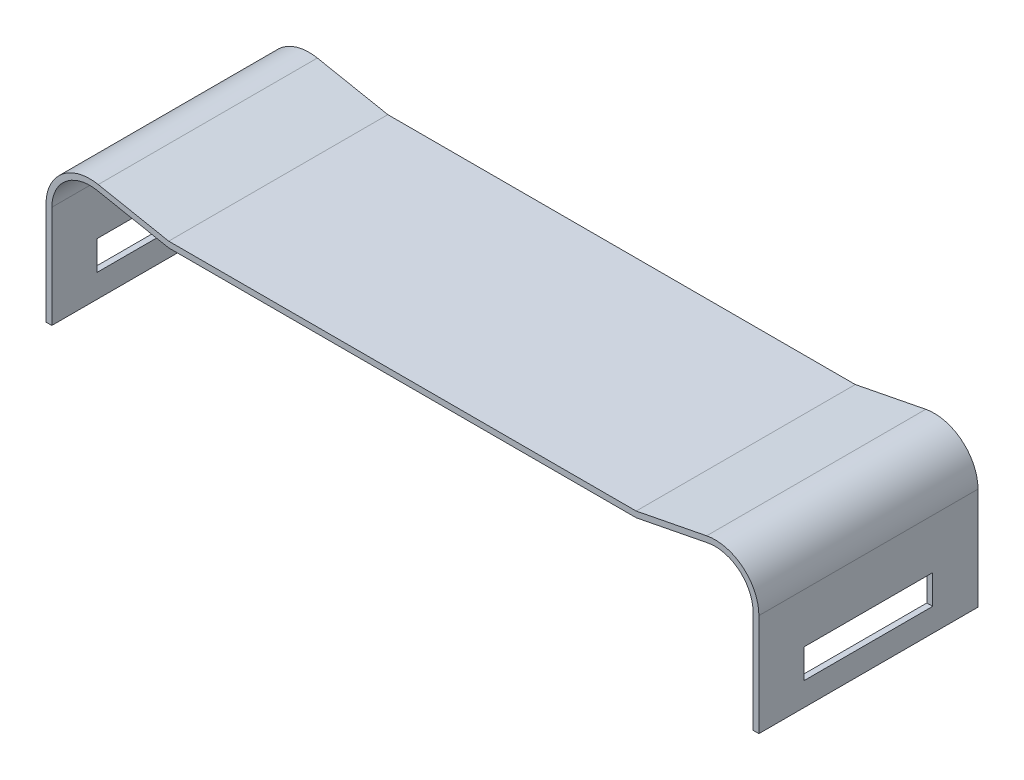
ISO-10303-21;
HEADER;
FILE_DESCRIPTION(('STEP AP214'),'2;1');
FILE_NAME('part.step','',(''),(''),'','','');
FILE_SCHEMA(('AUTOMOTIVE_DESIGN { 1 0 10303 214 1 1 1 1 }'));
ENDSEC;
DATA;
#1=APPLICATION_CONTEXT('core data for automotive mechanical design processes');
#2=APPLICATION_PROTOCOL_DEFINITION('international standard','automotive_design',2000,#1);
#3=PRODUCT_CONTEXT('',#1,'mechanical');
#4=PRODUCT('Part','Part','',(#3));
#5=PRODUCT_RELATED_PRODUCT_CATEGORY('part','',(#4));
#6=PRODUCT_DEFINITION_FORMATION('','',#4);
#7=PRODUCT_DEFINITION_CONTEXT('part definition',#1,'design');
#8=PRODUCT_DEFINITION('design','',#6,#7);
#9=PRODUCT_DEFINITION_SHAPE('','',#8);
#10=(LENGTH_UNIT() NAMED_UNIT(*) SI_UNIT(.MILLI.,.METRE.));
#11=(NAMED_UNIT(*) PLANE_ANGLE_UNIT() SI_UNIT($,.RADIAN.));
#12=(NAMED_UNIT(*) SI_UNIT($,.STERADIAN.) SOLID_ANGLE_UNIT());
#13=UNCERTAINTY_MEASURE_WITH_UNIT(LENGTH_MEASURE(1.E-05),#10,'distance_accuracy_value','');
#14=(GEOMETRIC_REPRESENTATION_CONTEXT(3) GLOBAL_UNCERTAINTY_ASSIGNED_CONTEXT((#13)) GLOBAL_UNIT_ASSIGNED_CONTEXT((#10,
#11,#12)) REPRESENTATION_CONTEXT('',''));
#15=CARTESIAN_POINT('',(0.,0.,0.));
#16=DIRECTION('',(0.,0.,1.));
#17=DIRECTION('',(1.,0.,0.));
#18=AXIS2_PLACEMENT_3D('',#15,#16,#17);
#19=CARTESIAN_POINT('',(24.,13.9,29.9));
#20=DIRECTION('',(0.,1.,0.));
#21=DIRECTION('',(-1.,0.,0.));
#22=AXIS2_PLACEMENT_3D('',#19,#20,#21);
#23=PLANE('',#22);
#24=DIRECTION('',(-1.,0.,0.));
#25=VECTOR('',#24,1.);
#26=CARTESIAN_POINT('',(24.,13.9,29.9));
#27=LINE('',#26,#25);
#28=CARTESIAN_POINT('',(24.,13.9,29.9));
#29=VERTEX_POINT('',#28);
#30=CARTESIAN_POINT('',(24.4,13.9,29.9));
#31=VERTEX_POINT('',#30);
#32=EDGE_CURVE('E306',#29,#31,#27,.F.);
#33=ORIENTED_EDGE('',*,*,#32,.F.);
#34=DIRECTION('',(0.,0.,1.));
#35=VECTOR('',#34,1.);
#36=CARTESIAN_POINT('',(24.,13.9,29.9));
#37=LINE('',#36,#35);
#38=CARTESIAN_POINT('',(24.,13.9,14.9));
#39=VERTEX_POINT('',#38);
#40=EDGE_CURVE('E190',#29,#39,#37,.F.);
#41=ORIENTED_EDGE('',*,*,#40,.T.);
#42=DIRECTION('',(-1.,0.,0.));
#43=VECTOR('',#42,1.);
#44=CARTESIAN_POINT('',(24.,13.9,14.9));
#45=LINE('',#44,#43);
#46=CARTESIAN_POINT('',(24.4,13.9,14.9));
#47=VERTEX_POINT('',#46);
#48=EDGE_CURVE('E198',#47,#39,#45,.T.);
#49=ORIENTED_EDGE('',*,*,#48,.F.);
#50=DIRECTION('',(0.,0.,1.));
#51=VECTOR('',#50,1.);
#52=CARTESIAN_POINT('',(24.4,13.9,29.9));
#53=LINE('',#52,#51);
#54=EDGE_CURVE('E241',#47,#31,#53,.T.);
#55=ORIENTED_EDGE('',*,*,#54,.T.);
#56=EDGE_LOOP('',(#33,#41,#49,#55));
#57=FACE_BOUND('',#56,.T.);
#58=ADVANCED_FACE('F17',(#57),#23,.F.);
#59=CARTESIAN_POINT('',(24.4,15.5,26.8));
#60=DIRECTION('',(0.,0.,1.));
#61=DIRECTION('',(0.,-1.,0.));
#62=AXIS2_PLACEMENT_3D('',#59,#60,#61);
#63=PLANE('',#62);
#64=DIRECTION('',(1.,0.,0.));
#65=VECTOR('',#64,1.);
#66=CARTESIAN_POINT('',(24.4,15.5,26.8));
#67=LINE('',#66,#65);
#68=CARTESIAN_POINT('',(24.4,15.5,26.8));
#69=VERTEX_POINT('',#68);
#70=CARTESIAN_POINT('',(24.,15.5,26.8));
#71=VERTEX_POINT('',#70);
#72=EDGE_CURVE('E304',#69,#71,#67,.F.);
#73=ORIENTED_EDGE('',*,*,#72,.T.);
#74=DIRECTION('',(0.,1.,0.));
#75=VECTOR('',#74,1.);
#76=CARTESIAN_POINT('',(24.,20.907589769271,26.8));
#77=LINE('',#76,#75);
#78=CARTESIAN_POINT('',(24.,17.5,26.8));
#79=VERTEX_POINT('',#78);
#80=EDGE_CURVE('E249',#71,#79,#77,.T.);
#81=ORIENTED_EDGE('',*,*,#80,.T.);
#82=DIRECTION('',(1.,0.,0.));
#83=VECTOR('',#82,1.);
#84=CARTESIAN_POINT('',(24.4,17.5,26.8));
#85=LINE('',#84,#83);
#86=CARTESIAN_POINT('',(24.4,17.5,26.8));
#87=VERTEX_POINT('',#86);
#88=EDGE_CURVE('E291',#79,#87,#85,.T.);
#89=ORIENTED_EDGE('',*,*,#88,.T.);
#90=DIRECTION('',(0.,-1.,0.));
#91=VECTOR('',#90,1.);
#92=CARTESIAN_POINT('',(24.4,13.9,26.8));
#93=LINE('',#92,#91);
#94=EDGE_CURVE('E238',#87,#69,#93,.T.);
#95=ORIENTED_EDGE('',*,*,#94,.T.);
#96=EDGE_LOOP('',(#73,#81,#89,#95));
#97=FACE_BOUND('',#96,.T.);
#98=ADVANCED_FACE('F551',(#97),#63,.F.);
#99=CARTESIAN_POINT('',(24.4,15.5,18.));
#100=DIRECTION('',(0.,-1.,0.));
#101=DIRECTION('',(0.,0.,-1.));
#102=AXIS2_PLACEMENT_3D('',#99,#100,#101);
#103=PLANE('',#102);
#104=DIRECTION('',(1.,0.,0.));
#105=VECTOR('',#104,1.);
#106=CARTESIAN_POINT('',(24.4,15.5,18.));
#107=LINE('',#106,#105);
#108=CARTESIAN_POINT('',(24.4,15.5,18.));
#109=VERTEX_POINT('',#108);
#110=CARTESIAN_POINT('',(24.,15.5,18.));
#111=VERTEX_POINT('',#110);
#112=EDGE_CURVE('E302',#109,#111,#107,.F.);
#113=ORIENTED_EDGE('',*,*,#112,.T.);
#114=DIRECTION('',(0.,0.,1.));
#115=VECTOR('',#114,1.);
#116=CARTESIAN_POINT('',(24.,15.5,29.9));
#117=LINE('',#116,#115);
#118=EDGE_CURVE('E252',#111,#71,#117,.T.);
#119=ORIENTED_EDGE('',*,*,#118,.T.);
#120=ORIENTED_EDGE('',*,*,#72,.F.);
#121=DIRECTION('',(0.,0.,1.));
#122=VECTOR('',#121,1.);
#123=CARTESIAN_POINT('',(24.4,15.5,29.9));
#124=LINE('',#123,#122);
#125=EDGE_CURVE('E235',#69,#109,#124,.F.);
#126=ORIENTED_EDGE('',*,*,#125,.T.);
#127=EDGE_LOOP('',(#113,#119,#120,#126));
#128=FACE_BOUND('',#127,.T.);
#129=ADVANCED_FACE('F548',(#128),#103,.F.);
#130=CARTESIAN_POINT('',(24.4,15.5,18.));
#131=DIRECTION('',(0.,0.,-1.));
#132=DIRECTION('',(0.,1.,0.));
#133=AXIS2_PLACEMENT_3D('',#130,#131,#132);
#134=PLANE('',#133);
#135=DIRECTION('',(1.,0.,0.));
#136=VECTOR('',#135,1.);
#137=CARTESIAN_POINT('',(24.4,17.5,18.));
#138=LINE('',#137,#136);
#139=CARTESIAN_POINT('',(24.4,17.5,18.));
#140=VERTEX_POINT('',#139);
#141=CARTESIAN_POINT('',(24.,17.5,18.));
#142=VERTEX_POINT('',#141);
#143=EDGE_CURVE('E299',#140,#142,#138,.F.);
#144=ORIENTED_EDGE('',*,*,#143,.T.);
#145=DIRECTION('',(0.,1.,0.));
#146=VECTOR('',#145,1.);
#147=CARTESIAN_POINT('',(24.,20.907589769271,18.));
#148=LINE('',#147,#146);
#149=EDGE_CURVE('E255',#142,#111,#148,.F.);
#150=ORIENTED_EDGE('',*,*,#149,.T.);
#151=ORIENTED_EDGE('',*,*,#112,.F.);
#152=DIRECTION('',(0.,-1.,0.));
#153=VECTOR('',#152,1.);
#154=CARTESIAN_POINT('',(24.4,13.9,18.));
#155=LINE('',#154,#153);
#156=EDGE_CURVE('E232',#109,#140,#155,.F.);
#157=ORIENTED_EDGE('',*,*,#156,.T.);
#158=EDGE_LOOP('',(#144,#150,#151,#157));
#159=FACE_BOUND('',#158,.T.);
#160=ADVANCED_FACE('F544',(#159),#134,.F.);
#161=CARTESIAN_POINT('',(24.4,17.5,18.));
#162=DIRECTION('',(0.,1.,0.));
#163=DIRECTION('',(0.,0.,1.));
#164=AXIS2_PLACEMENT_3D('',#161,#162,#163);
#165=PLANE('',#164);
#166=ORIENTED_EDGE('',*,*,#88,.F.);
#167=DIRECTION('',(0.,0.,1.));
#168=VECTOR('',#167,1.);
#169=CARTESIAN_POINT('',(24.,17.5,29.9));
#170=LINE('',#169,#168);
#171=EDGE_CURVE('E244',#79,#142,#170,.F.);
#172=ORIENTED_EDGE('',*,*,#171,.T.);
#173=ORIENTED_EDGE('',*,*,#143,.F.);
#174=DIRECTION('',(0.,0.,1.));
#175=VECTOR('',#174,1.);
#176=CARTESIAN_POINT('',(24.4,17.5,29.9));
#177=LINE('',#176,#175);
#178=EDGE_CURVE('E229',#140,#87,#177,.T.);
#179=ORIENTED_EDGE('',*,*,#178,.T.);
#180=EDGE_LOOP('',(#166,#172,#173,#179));
#181=FACE_BOUND('',#180,.T.);
#182=ADVANCED_FACE('F541',(#181),#165,.F.);
#183=CARTESIAN_POINT('',(-24.,13.9,29.9));
#184=DIRECTION('',(0.,1.,0.));
#185=DIRECTION('',(-1.,0.,0.));
#186=AXIS2_PLACEMENT_3D('',#183,#184,#185);
#187=PLANE('',#186);
#188=DIRECTION('',(-1.,0.,0.));
#189=VECTOR('',#188,1.);
#190=CARTESIAN_POINT('',(-24.,13.9,29.9));
#191=LINE('',#190,#189);
#192=CARTESIAN_POINT('',(-24.4,13.9,29.9));
#193=VERTEX_POINT('',#192);
#194=CARTESIAN_POINT('',(-24.,13.9,29.9));
#195=VERTEX_POINT('',#194);
#196=EDGE_CURVE('E288',#193,#195,#191,.F.);
#197=ORIENTED_EDGE('',*,*,#196,.F.);
#198=DIRECTION('',(0.,0.,1.));
#199=VECTOR('',#198,1.);
#200=CARTESIAN_POINT('',(-24.4,13.9,29.9));
#201=LINE('',#200,#199);
#202=CARTESIAN_POINT('',(-24.4,13.9,14.9));
#203=VERTEX_POINT('',#202);
#204=EDGE_CURVE('E228',#193,#203,#201,.F.);
#205=ORIENTED_EDGE('',*,*,#204,.T.);
#206=DIRECTION('',(-1.,0.,0.));
#207=VECTOR('',#206,1.);
#208=CARTESIAN_POINT('',(-24.,13.9,14.9));
#209=LINE('',#208,#207);
#210=CARTESIAN_POINT('',(-24.,13.9,14.9));
#211=VERTEX_POINT('',#210);
#212=EDGE_CURVE('E289',#211,#203,#209,.T.);
#213=ORIENTED_EDGE('',*,*,#212,.F.);
#214=DIRECTION('',(0.,0.,1.));
#215=VECTOR('',#214,1.);
#216=CARTESIAN_POINT('',(-24.,13.9,29.9));
#217=LINE('',#216,#215);
#218=EDGE_CURVE('E393',#211,#195,#217,.T.);
#219=ORIENTED_EDGE('',*,*,#218,.T.);
#220=EDGE_LOOP('',(#197,#205,#213,#219));
#221=FACE_BOUND('',#220,.T.);
#222=ADVANCED_FACE('F413',(#221),#187,.F.);
#223=CARTESIAN_POINT('',(24.4,15.5,26.8));
#224=DIRECTION('',(0.,0.,1.));
#225=DIRECTION('',(0.,-1.,0.));
#226=AXIS2_PLACEMENT_3D('',#223,#224,#225);
#227=PLANE('',#226);
#228=DIRECTION('',(1.,0.,0.));
#229=VECTOR('',#228,1.);
#230=CARTESIAN_POINT('',(24.4,17.5,26.8));
#231=LINE('',#230,#229);
#232=CARTESIAN_POINT('',(-24.4,17.5,26.8));
#233=VERTEX_POINT('',#232);
#234=CARTESIAN_POINT('',(-24.,17.5,26.8));
#235=VERTEX_POINT('',#234);
#236=EDGE_CURVE('E281',#233,#235,#231,.T.);
#237=ORIENTED_EDGE('',*,*,#236,.T.);
#238=DIRECTION('',(0.,-1.,0.));
#239=VECTOR('',#238,1.);
#240=CARTESIAN_POINT('',(-24.,20.907589769271,26.8));
#241=LINE('',#240,#239);
#242=CARTESIAN_POINT('',(-24.,15.5,26.8));
#243=VERTEX_POINT('',#242);
#244=EDGE_CURVE('E390',#235,#243,#241,.T.);
#245=ORIENTED_EDGE('',*,*,#244,.T.);
#246=DIRECTION('',(1.,0.,0.));
#247=VECTOR('',#246,1.);
#248=CARTESIAN_POINT('',(24.4,15.5,26.8));
#249=LINE('',#248,#247);
#250=CARTESIAN_POINT('',(-24.4,15.5,26.8));
#251=VERTEX_POINT('',#250);
#252=EDGE_CURVE('E286',#243,#251,#249,.F.);
#253=ORIENTED_EDGE('',*,*,#252,.T.);
#254=DIRECTION('',(0.,1.,0.));
#255=VECTOR('',#254,1.);
#256=CARTESIAN_POINT('',(-24.4,13.9,26.8));
#257=LINE('',#256,#255);
#258=EDGE_CURVE('E401',#251,#233,#257,.T.);
#259=ORIENTED_EDGE('',*,*,#258,.T.);
#260=EDGE_LOOP('',(#237,#245,#253,#259));
#261=FACE_BOUND('',#260,.T.);
#262=ADVANCED_FACE('F534',(#261),#227,.F.);
#263=CARTESIAN_POINT('',(24.4,15.5,18.));
#264=DIRECTION('',(0.,-1.,0.));
#265=DIRECTION('',(0.,0.,-1.));
#266=AXIS2_PLACEMENT_3D('',#263,#264,#265);
#267=PLANE('',#266);
#268=ORIENTED_EDGE('',*,*,#252,.F.);
#269=DIRECTION('',(0.,0.,1.));
#270=VECTOR('',#269,1.);
#271=CARTESIAN_POINT('',(-24.,15.5,29.9));
#272=LINE('',#271,#270);
#273=CARTESIAN_POINT('',(-24.,15.5,18.));
#274=VERTEX_POINT('',#273);
#275=EDGE_CURVE('E387',#243,#274,#272,.F.);
#276=ORIENTED_EDGE('',*,*,#275,.T.);
#277=DIRECTION('',(1.,0.,0.));
#278=VECTOR('',#277,1.);
#279=CARTESIAN_POINT('',(24.4,15.5,18.));
#280=LINE('',#279,#278);
#281=CARTESIAN_POINT('',(-24.4,15.5,18.));
#282=VERTEX_POINT('',#281);
#283=EDGE_CURVE('E284',#274,#282,#280,.F.);
#284=ORIENTED_EDGE('',*,*,#283,.T.);
#285=DIRECTION('',(0.,0.,1.));
#286=VECTOR('',#285,1.);
#287=CARTESIAN_POINT('',(-24.4,15.5,29.9));
#288=LINE('',#287,#286);
#289=EDGE_CURVE('E404',#282,#251,#288,.T.);
#290=ORIENTED_EDGE('',*,*,#289,.T.);
#291=EDGE_LOOP('',(#268,#276,#284,#290));
#292=FACE_BOUND('',#291,.T.);
#293=ADVANCED_FACE('F530',(#292),#267,.F.);
#294=CARTESIAN_POINT('',(24.4,15.5,18.));
#295=DIRECTION('',(0.,0.,-1.));
#296=DIRECTION('',(0.,1.,0.));
#297=AXIS2_PLACEMENT_3D('',#294,#295,#296);
#298=PLANE('',#297);
#299=ORIENTED_EDGE('',*,*,#283,.F.);
#300=DIRECTION('',(0.,-1.,0.));
#301=VECTOR('',#300,1.);
#302=CARTESIAN_POINT('',(-24.,20.907589769271,18.));
#303=LINE('',#302,#301);
#304=CARTESIAN_POINT('',(-24.,17.5,18.));
#305=VERTEX_POINT('',#304);
#306=EDGE_CURVE('E384',#274,#305,#303,.F.);
#307=ORIENTED_EDGE('',*,*,#306,.T.);
#308=DIRECTION('',(1.,0.,0.));
#309=VECTOR('',#308,1.);
#310=CARTESIAN_POINT('',(24.4,17.5,18.));
#311=LINE('',#310,#309);
#312=CARTESIAN_POINT('',(-24.4,17.5,18.));
#313=VERTEX_POINT('',#312);
#314=EDGE_CURVE('E265',#305,#313,#311,.F.);
#315=ORIENTED_EDGE('',*,*,#314,.T.);
#316=DIRECTION('',(0.,1.,0.));
#317=VECTOR('',#316,1.);
#318=CARTESIAN_POINT('',(-24.4,13.9,18.));
#319=LINE('',#318,#317);
#320=EDGE_CURVE('E407',#313,#282,#319,.F.);
#321=ORIENTED_EDGE('',*,*,#320,.T.);
#322=EDGE_LOOP('',(#299,#307,#315,#321));
#323=FACE_BOUND('',#322,.T.);
#324=ADVANCED_FACE('F526',(#323),#298,.F.);
#325=CARTESIAN_POINT('',(24.4,17.5,18.));
#326=DIRECTION('',(0.,1.,0.));
#327=DIRECTION('',(0.,0.,1.));
#328=AXIS2_PLACEMENT_3D('',#325,#326,#327);
#329=PLANE('',#328);
#330=ORIENTED_EDGE('',*,*,#314,.F.);
#331=DIRECTION('',(0.,0.,1.));
#332=VECTOR('',#331,1.);
#333=CARTESIAN_POINT('',(-24.,17.5,29.9));
#334=LINE('',#333,#332);
#335=EDGE_CURVE('E381',#305,#235,#334,.T.);
#336=ORIENTED_EDGE('',*,*,#335,.T.);
#337=ORIENTED_EDGE('',*,*,#236,.F.);
#338=DIRECTION('',(0.,0.,1.));
#339=VECTOR('',#338,1.);
#340=CARTESIAN_POINT('',(-24.4,17.5,29.9));
#341=LINE('',#340,#339);
#342=EDGE_CURVE('E396',#233,#313,#341,.F.);
#343=ORIENTED_EDGE('',*,*,#342,.T.);
#344=EDGE_LOOP('',(#330,#336,#337,#343));
#345=FACE_BOUND('',#344,.T.);
#346=ADVANCED_FACE('F523',(#345),#329,.F.);
#347=CARTESIAN_POINT('',(-16.,22.5,29.9));
#348=DIRECTION('',(0.,1.,0.));
#349=DIRECTION('',(0.,0.,1.));
#350=AXIS2_PLACEMENT_3D('',#347,#348,#349);
#351=PLANE('',#350);
#352=DIRECTION('',(1.,0.,0.));
#353=VECTOR('',#352,1.);
#354=CARTESIAN_POINT('',(21.4,22.5,29.9));
#355=LINE('',#354,#353);
#356=CARTESIAN_POINT('',(-16.0000000000001,22.5,29.9));
#357=VERTEX_POINT('',#356);
#358=CARTESIAN_POINT('',(16.,22.5,29.9));
#359=VERTEX_POINT('',#358);
#360=EDGE_CURVE('E218',#357,#359,#355,.T.);
#361=ORIENTED_EDGE('',*,*,#360,.F.);
#362=DIRECTION('',(0.,0.,1.));
#363=VECTOR('',#362,1.);
#364=CARTESIAN_POINT('',(-16.,22.5,29.9));
#365=LINE('',#364,#363);
#366=CARTESIAN_POINT('',(-16.,22.5,14.9));
#367=VERTEX_POINT('',#366);
#368=EDGE_CURVE('E204',#357,#367,#365,.F.);
#369=ORIENTED_EDGE('',*,*,#368,.T.);
#370=DIRECTION('',(1.,0.,0.));
#371=VECTOR('',#370,1.);
#372=CARTESIAN_POINT('',(21.4,22.5,14.9));
#373=LINE('',#372,#371);
#374=CARTESIAN_POINT('',(16.,22.5,14.9));
#375=VERTEX_POINT('',#374);
#376=EDGE_CURVE('E273',#367,#375,#373,.T.);
#377=ORIENTED_EDGE('',*,*,#376,.T.);
#378=DIRECTION('',(0.,0.,1.));
#379=VECTOR('',#378,1.);
#380=CARTESIAN_POINT('',(16.,22.5,29.9));
#381=LINE('',#380,#379);
#382=EDGE_CURVE('E262',#375,#359,#381,.T.);
#383=ORIENTED_EDGE('',*,*,#382,.T.);
#384=EDGE_LOOP('',(#361,#369,#377,#383));
#385=FACE_BOUND('',#384,.T.);
#386=ADVANCED_FACE('F460',(#385),#351,.F.);
#387=CARTESIAN_POINT('',(16.,22.5,29.9));
#388=DIRECTION('',(-0.192081888360959,0.981378901425789,0.));
#389=DIRECTION('',(-0.981378901425789,-0.192081888360959,0.));
#390=AXIS2_PLACEMENT_3D('',#387,#388,#389);
#391=PLANE('',#390);
#392=DIRECTION('',(0.981378901425802,0.19208188836089,0.));
#393=VECTOR('',#392,1.);
#394=CARTESIAN_POINT('',(16.,22.5,29.9));
#395=LINE('',#394,#393);
#396=CARTESIAN_POINT('',(20.9005870902618,23.4591749129785,29.9));
#397=VERTEX_POINT('',#396);
#398=EDGE_CURVE('E326',#359,#397,#395,.T.);
#399=ORIENTED_EDGE('',*,*,#398,.F.);
#400=ORIENTED_EDGE('',*,*,#382,.F.);
#401=DIRECTION('',(0.981378901425802,0.19208188836089,0.));
#402=VECTOR('',#401,1.);
#403=CARTESIAN_POINT('',(16.,22.5,14.9));
#404=LINE('',#403,#402);
#405=CARTESIAN_POINT('',(20.9005870902618,23.4591749129785,14.9));
#406=VERTEX_POINT('',#405);
#407=EDGE_CURVE('E270',#375,#406,#404,.T.);
#408=ORIENTED_EDGE('',*,*,#407,.T.);
#409=DIRECTION('',(0.,0.,1.));
#410=VECTOR('',#409,1.);
#411=CARTESIAN_POINT('',(20.9005870902622,23.4591749129782,29.9));
#412=LINE('',#411,#410);
#413=EDGE_CURVE('E176',#406,#397,#412,.T.);
#414=ORIENTED_EDGE('',*,*,#413,.T.);
#415=EDGE_LOOP('',(#399,#400,#408,#414));
#416=FACE_BOUND('',#415,.T.);
#417=ADVANCED_FACE('F463',(#416),#391,.F.);
#418=CARTESIAN_POINT('',(21.4,20.907589769271,29.9));
#419=DIRECTION('',(0.,0.,1.));
#420=DIRECTION('',(0.,-1.,0.));
#421=AXIS2_PLACEMENT_3D('',#418,#419,#420);
#422=CYLINDRICAL_SURFACE('',#421,2.6);
#423=CARTESIAN_POINT('',(21.4,20.907589769271,29.9));
#424=DIRECTION('',(0.,0.,1.));
#425=DIRECTION('',(0.,-1.,0.));
#426=AXIS2_PLACEMENT_3D('',#423,#424,#425);
#427=CIRCLE('',#426,2.6);
#428=CARTESIAN_POINT('',(24.,20.907589769271,29.9));
#429=VERTEX_POINT('',#428);
#430=EDGE_CURVE('E324',#397,#429,#427,.F.);
#431=ORIENTED_EDGE('',*,*,#430,.F.);
#432=ORIENTED_EDGE('',*,*,#413,.F.);
#433=CARTESIAN_POINT('',(21.4,20.907589769271,14.9));
#434=DIRECTION('',(0.,0.,1.));
#435=DIRECTION('',(0.,-1.,0.));
#436=AXIS2_PLACEMENT_3D('',#433,#434,#435);
#437=CIRCLE('',#436,2.6);
#438=CARTESIAN_POINT('',(24.,20.907589769271,14.9));
#439=VERTEX_POINT('',#438);
#440=EDGE_CURVE('E20',#406,#439,#437,.F.);
#441=ORIENTED_EDGE('',*,*,#440,.T.);
#442=DIRECTION('',(0.,0.,1.));
#443=VECTOR('',#442,1.);
#444=CARTESIAN_POINT('',(24.,20.907589769271,29.9));
#445=LINE('',#444,#443);
#446=EDGE_CURVE('E183',#439,#429,#445,.T.);
#447=ORIENTED_EDGE('',*,*,#446,.T.);
#448=EDGE_LOOP('',(#431,#432,#441,#447));
#449=FACE_BOUND('',#448,.T.);
#450=ADVANCED_FACE('F202',(#449),#422,.F.);
#451=CARTESIAN_POINT('',(24.,20.907589769271,29.9));
#452=DIRECTION('',(1.,0.,0.));
#453=DIRECTION('',(0.,1.,0.));
#454=AXIS2_PLACEMENT_3D('',#451,#452,#453);
#455=PLANE('',#454);
#456=ORIENTED_EDGE('',*,*,#80,.F.);
#457=ORIENTED_EDGE('',*,*,#118,.F.);
#458=ORIENTED_EDGE('',*,*,#149,.F.);
#459=ORIENTED_EDGE('',*,*,#171,.F.);
#460=EDGE_LOOP('',(#456,#457,#458,#459));
#461=FACE_BOUND('',#460,.T.);
#462=DIRECTION('',(0.,-1.,0.));
#463=VECTOR('',#462,1.);
#464=CARTESIAN_POINT('',(24.,20.907589769271,29.9));
#465=LINE('',#464,#463);
#466=EDGE_CURVE('E189',#429,#29,#465,.T.);
#467=ORIENTED_EDGE('',*,*,#466,.F.);
#468=ORIENTED_EDGE('',*,*,#446,.F.);
#469=DIRECTION('',(0.,-1.,0.));
#470=VECTOR('',#469,1.);
#471=CARTESIAN_POINT('',(24.,20.907589769271,14.9));
#472=LINE('',#471,#470);
#473=EDGE_CURVE('E187',#439,#39,#472,.T.);
#474=ORIENTED_EDGE('',*,*,#473,.T.);
#475=ORIENTED_EDGE('',*,*,#40,.F.);
#476=EDGE_LOOP('',(#467,#468,#474,#475));
#477=FACE_BOUND('',#476,.T.);
#478=ADVANCED_FACE('F185',(#461,#477),#455,.F.);
#479=CARTESIAN_POINT('',(24.4,13.9,29.9));
#480=DIRECTION('',(-1.,0.,0.));
#481=DIRECTION('',(0.,-1.,0.));
#482=AXIS2_PLACEMENT_3D('',#479,#480,#481);
#483=PLANE('',#482);
#484=ORIENTED_EDGE('',*,*,#156,.F.);
#485=ORIENTED_EDGE('',*,*,#125,.F.);
#486=ORIENTED_EDGE('',*,*,#94,.F.);
#487=ORIENTED_EDGE('',*,*,#178,.F.);
#488=EDGE_LOOP('',(#484,#485,#486,#487));
#489=FACE_BOUND('',#488,.T.);
#490=DIRECTION('',(0.,-1.,0.));
#491=VECTOR('',#490,1.);
#492=CARTESIAN_POINT('',(24.4,20.907589769271,29.9));
#493=LINE('',#492,#491);
#494=CARTESIAN_POINT('',(24.4,20.9,29.9));
#495=VERTEX_POINT('',#494);
#496=EDGE_CURVE('E323',#31,#495,#493,.F.);
#497=ORIENTED_EDGE('',*,*,#496,.F.);
#498=ORIENTED_EDGE('',*,*,#54,.F.);
#499=DIRECTION('',(0.,-1.,0.));
#500=VECTOR('',#499,1.);
#501=CARTESIAN_POINT('',(24.4,20.907589769271,14.9));
#502=LINE('',#501,#500);
#503=CARTESIAN_POINT('',(24.4,20.9,14.9));
#504=VERTEX_POINT('',#503);
#505=EDGE_CURVE('E200',#47,#504,#502,.F.);
#506=ORIENTED_EDGE('',*,*,#505,.T.);
#507=DIRECTION('',(0.,0.,1.));
#508=VECTOR('',#507,1.);
#509=CARTESIAN_POINT('',(24.4,20.9,29.9));
#510=LINE('',#509,#508);
#511=EDGE_CURVE('E226',#495,#504,#510,.F.);
#512=ORIENTED_EDGE('',*,*,#511,.F.);
#513=EDGE_LOOP('',(#497,#498,#506,#512));
#514=FACE_BOUND('',#513,.T.);
#515=ADVANCED_FACE('F466',(#489,#514),#483,.F.);
#516=CARTESIAN_POINT('',(21.4,20.9,29.9));
#517=DIRECTION('',(0.,0.,1.));
#518=DIRECTION('',(0.,-1.,0.));
#519=AXIS2_PLACEMENT_3D('',#516,#517,#518);
#520=CYLINDRICAL_SURFACE('',#519,3.);
#521=CARTESIAN_POINT('',(21.4,20.9,14.9));
#522=DIRECTION('',(0.,0.,1.));
#523=DIRECTION('',(0.,-1.,0.));
#524=AXIS2_PLACEMENT_3D('',#521,#522,#523);
#525=CIRCLE('',#524,3.);
#526=CARTESIAN_POINT('',(20.8237543349174,23.8441367042782,14.9));
#527=VERTEX_POINT('',#526);
#528=EDGE_CURVE('E333',#504,#527,#525,.T.);
#529=ORIENTED_EDGE('',*,*,#528,.T.);
#530=DIRECTION('',(0.,0.,1.));
#531=VECTOR('',#530,1.);
#532=CARTESIAN_POINT('',(20.8237543349178,23.8441367042783,29.9));
#533=LINE('',#532,#531);
#534=CARTESIAN_POINT('',(20.8237543349179,23.8441367042776,29.9));
#535=VERTEX_POINT('',#534);
#536=EDGE_CURVE('E215',#527,#535,#533,.T.);
#537=ORIENTED_EDGE('',*,*,#536,.T.);
#538=CARTESIAN_POINT('',(21.4,20.9,29.9));
#539=DIRECTION('',(0.,0.,1.));
#540=DIRECTION('',(0.,-1.,0.));
#541=AXIS2_PLACEMENT_3D('',#538,#539,#540);
#542=CIRCLE('',#541,3.);
#543=EDGE_CURVE('E321',#495,#535,#542,.T.);
#544=ORIENTED_EDGE('',*,*,#543,.F.);
#545=ORIENTED_EDGE('',*,*,#511,.T.);
#546=EDGE_LOOP('',(#529,#537,#544,#545));
#547=FACE_BOUND('',#546,.T.);
#548=ADVANCED_FACE('F468',(#547),#520,.T.);
#549=CARTESIAN_POINT('',(-24.4,13.9,29.9));
#550=DIRECTION('',(1.,0.,0.));
#551=DIRECTION('',(0.,1.,0.));
#552=AXIS2_PLACEMENT_3D('',#549,#550,#551);
#553=PLANE('',#552);
#554=ORIENTED_EDGE('',*,*,#258,.F.);
#555=ORIENTED_EDGE('',*,*,#289,.F.);
#556=ORIENTED_EDGE('',*,*,#320,.F.);
#557=ORIENTED_EDGE('',*,*,#342,.F.);
#558=EDGE_LOOP('',(#554,#555,#556,#557));
#559=FACE_BOUND('',#558,.T.);
#560=DIRECTION('',(0.,-1.,0.));
#561=VECTOR('',#560,1.);
#562=CARTESIAN_POINT('',(-24.4,20.907589769271,29.9));
#563=LINE('',#562,#561);
#564=CARTESIAN_POINT('',(-24.4,20.9,29.9));
#565=VERTEX_POINT('',#564);
#566=EDGE_CURVE('E319',#565,#193,#563,.T.);
#567=ORIENTED_EDGE('',*,*,#566,.F.);
#568=DIRECTION('',(0.,0.,1.));
#569=VECTOR('',#568,1.);
#570=CARTESIAN_POINT('',(-24.4,20.9,29.9));
#571=LINE('',#570,#569);
#572=CARTESIAN_POINT('',(-24.4,20.9,14.9));
#573=VERTEX_POINT('',#572);
#574=EDGE_CURVE('E203',#573,#565,#571,.T.);
#575=ORIENTED_EDGE('',*,*,#574,.F.);
#576=DIRECTION('',(0.,-1.,0.));
#577=VECTOR('',#576,1.);
#578=CARTESIAN_POINT('',(-24.4,20.907589769271,14.9));
#579=LINE('',#578,#577);
#580=EDGE_CURVE('E332',#573,#203,#579,.T.);
#581=ORIENTED_EDGE('',*,*,#580,.T.);
#582=ORIENTED_EDGE('',*,*,#204,.F.);
#583=EDGE_LOOP('',(#567,#575,#581,#582));
#584=FACE_BOUND('',#583,.T.);
#585=ADVANCED_FACE('F419',(#559,#584),#553,.F.);
#586=CARTESIAN_POINT('',(-24.,20.907589769271,29.9));
#587=DIRECTION('',(-1.,0.,0.));
#588=DIRECTION('',(0.,-1.,0.));
#589=AXIS2_PLACEMENT_3D('',#586,#587,#588);
#590=PLANE('',#589);
#591=ORIENTED_EDGE('',*,*,#306,.F.);
#592=ORIENTED_EDGE('',*,*,#275,.F.);
#593=ORIENTED_EDGE('',*,*,#244,.F.);
#594=ORIENTED_EDGE('',*,*,#335,.F.);
#595=EDGE_LOOP('',(#591,#592,#593,#594));
#596=FACE_BOUND('',#595,.T.);
#597=DIRECTION('',(0.,-1.,0.));
#598=VECTOR('',#597,1.);
#599=CARTESIAN_POINT('',(-24.,20.907589769271,29.9));
#600=LINE('',#599,#598);
#601=CARTESIAN_POINT('',(-24.,20.907589769271,29.9));
#602=VERTEX_POINT('',#601);
#603=EDGE_CURVE('E316',#195,#602,#600,.F.);
#604=ORIENTED_EDGE('',*,*,#603,.F.);
#605=ORIENTED_EDGE('',*,*,#218,.F.);
#606=DIRECTION('',(0.,-1.,0.));
#607=VECTOR('',#606,1.);
#608=CARTESIAN_POINT('',(-24.,20.907589769271,14.9));
#609=LINE('',#608,#607);
#610=CARTESIAN_POINT('',(-24.,20.907589769271,14.9));
#611=VERTEX_POINT('',#610);
#612=EDGE_CURVE('E330',#211,#611,#609,.F.);
#613=ORIENTED_EDGE('',*,*,#612,.T.);
#614=DIRECTION('',(0.,0.,1.));
#615=VECTOR('',#614,1.);
#616=CARTESIAN_POINT('',(-24.,20.907589769271,29.9));
#617=LINE('',#616,#615);
#618=EDGE_CURVE('E372',#611,#602,#617,.T.);
#619=ORIENTED_EDGE('',*,*,#618,.T.);
#620=EDGE_LOOP('',(#604,#605,#613,#619));
#621=FACE_BOUND('',#620,.T.);
#622=ADVANCED_FACE('F501',(#596,#621),#590,.F.);
#623=CARTESIAN_POINT('',(-21.4,20.907589769271,29.9));
#624=DIRECTION('',(0.,0.,1.));
#625=DIRECTION('',(0.,-1.,0.));
#626=AXIS2_PLACEMENT_3D('',#623,#624,#625);
#627=CYLINDRICAL_SURFACE('',#626,2.6);
#628=CARTESIAN_POINT('',(-21.4,20.907589769271,29.9));
#629=DIRECTION('',(0.,0.,1.));
#630=DIRECTION('',(0.,-1.,0.));
#631=AXIS2_PLACEMENT_3D('',#628,#629,#630);
#632=CIRCLE('',#631,2.6);
#633=CARTESIAN_POINT('',(-20.9005870902606,23.4591749129791,29.9));
#634=VERTEX_POINT('',#633);
#635=EDGE_CURVE('E313',#602,#634,#632,.F.);
#636=ORIENTED_EDGE('',*,*,#635,.F.);
#637=ORIENTED_EDGE('',*,*,#618,.F.);
#638=CARTESIAN_POINT('',(-21.4,20.907589769271,14.9));
#639=DIRECTION('',(0.,0.,1.));
#640=DIRECTION('',(0.,-1.,0.));
#641=AXIS2_PLACEMENT_3D('',#638,#639,#640);
#642=CIRCLE('',#641,2.6);
#643=CARTESIAN_POINT('',(-20.9005870902606,23.4591749129791,14.9));
#644=VERTEX_POINT('',#643);
#645=EDGE_CURVE('E327',#611,#644,#642,.F.);
#646=ORIENTED_EDGE('',*,*,#645,.T.);
#647=DIRECTION('',(0.,0.,1.));
#648=VECTOR('',#647,1.);
#649=CARTESIAN_POINT('',(-20.90058709026,23.459174912979,29.9));
#650=LINE('',#649,#648);
#651=EDGE_CURVE('E209',#644,#634,#650,.T.);
#652=ORIENTED_EDGE('',*,*,#651,.T.);
#653=EDGE_LOOP('',(#636,#637,#646,#652));
#654=FACE_BOUND('',#653,.T.);
#655=ADVANCED_FACE('F498',(#654),#627,.F.);
#656=CARTESIAN_POINT('',(-16.,22.5,29.9));
#657=DIRECTION('',(0.192081888360959,0.981378901425789,0.));
#658=DIRECTION('',(-0.981378901425789,0.192081888360959,0.));
#659=AXIS2_PLACEMENT_3D('',#656,#657,#658);
#660=PLANE('',#659);
#661=DIRECTION('',(0.981378901425788,-0.192081888360965,0.));
#662=VECTOR('',#661,1.);
#663=CARTESIAN_POINT('',(-20.90058709026,23.459174912979,29.9));
#664=LINE('',#663,#662);
#665=EDGE_CURVE('E315',#634,#357,#664,.T.);
#666=ORIENTED_EDGE('',*,*,#665,.F.);
#667=ORIENTED_EDGE('',*,*,#651,.F.);
#668=DIRECTION('',(0.981378901425788,-0.192081888360965,0.));
#669=VECTOR('',#668,1.);
#670=CARTESIAN_POINT('',(-20.90058709026,23.459174912979,14.9));
#671=LINE('',#670,#669);
#672=EDGE_CURVE('E276',#644,#367,#671,.T.);
#673=ORIENTED_EDGE('',*,*,#672,.T.);
#674=ORIENTED_EDGE('',*,*,#368,.F.);
#675=EDGE_LOOP('',(#666,#667,#673,#674));
#676=FACE_BOUND('',#675,.T.);
#677=ADVANCED_FACE('F495',(#676),#660,.F.);
#678=CARTESIAN_POINT('',(-21.4,20.9,29.9));
#679=DIRECTION('',(0.,0.,1.));
#680=DIRECTION('',(0.,-1.,0.));
#681=AXIS2_PLACEMENT_3D('',#678,#679,#680);
#682=CYLINDRICAL_SURFACE('',#681,3.);
#683=CARTESIAN_POINT('',(-21.4,20.9,14.9));
#684=DIRECTION('',(0.,0.,1.));
#685=DIRECTION('',(0.,-1.,0.));
#686=AXIS2_PLACEMENT_3D('',#683,#684,#685);
#687=CIRCLE('',#686,3.);
#688=CARTESIAN_POINT('',(-20.8237543349135,23.8441367042774,14.9));
#689=VERTEX_POINT('',#688);
#690=EDGE_CURVE('E331',#689,#573,#687,.T.);
#691=ORIENTED_EDGE('',*,*,#690,.T.);
#692=ORIENTED_EDGE('',*,*,#574,.T.);
#693=CARTESIAN_POINT('',(-21.4,20.9,29.9));
#694=DIRECTION('',(0.,0.,1.));
#695=DIRECTION('',(0.,-1.,0.));
#696=AXIS2_PLACEMENT_3D('',#693,#694,#695);
#697=CIRCLE('',#696,3.);
#698=CARTESIAN_POINT('',(-20.8237543349135,23.8441367042774,29.9));
#699=VERTEX_POINT('',#698);
#700=EDGE_CURVE('E317',#699,#565,#697,.T.);
#701=ORIENTED_EDGE('',*,*,#700,.F.);
#702=DIRECTION('',(0.,0.,1.));
#703=VECTOR('',#702,1.);
#704=CARTESIAN_POINT('',(-20.82375433491,23.8441367042767,29.9));
#705=LINE('',#704,#703);
#706=EDGE_CURVE('E350',#699,#689,#705,.F.);
#707=ORIENTED_EDGE('',*,*,#706,.T.);
#708=EDGE_LOOP('',(#691,#692,#701,#707));
#709=FACE_BOUND('',#708,.T.);
#710=ADVANCED_FACE('F492',(#709),#682,.T.);
#711=CARTESIAN_POINT('',(21.4,20.907589769271,14.9));
#712=DIRECTION('',(0.,0.,1.));
#713=DIRECTION('',(0.,-1.,0.));
#714=AXIS2_PLACEMENT_3D('',#711,#712,#713);
#715=PLANE('',#714);
#716=ORIENTED_EDGE('',*,*,#376,.F.);
#717=ORIENTED_EDGE('',*,*,#672,.F.);
#718=ORIENTED_EDGE('',*,*,#645,.F.);
#719=ORIENTED_EDGE('',*,*,#612,.F.);
#720=ORIENTED_EDGE('',*,*,#212,.T.);
#721=ORIENTED_EDGE('',*,*,#580,.F.);
#722=ORIENTED_EDGE('',*,*,#690,.F.);
#723=DIRECTION('',(0.981378901425789,-0.192081888360959,0.));
#724=VECTOR('',#723,1.);
#725=CARTESIAN_POINT('',(-16.,22.9,14.9));
#726=LINE('',#725,#724);
#727=CARTESIAN_POINT('',(-16.0000000000001,22.9,14.9));
#728=VERTEX_POINT('',#727);
#729=EDGE_CURVE('E354',#689,#728,#726,.T.);
#730=ORIENTED_EDGE('',*,*,#729,.T.);
#731=DIRECTION('',(1.,0.,0.));
#732=VECTOR('',#731,1.);
#733=CARTESIAN_POINT('',(-16.,22.9,14.9));
#734=LINE('',#733,#732);
#735=CARTESIAN_POINT('',(16.,22.9,14.9));
#736=VERTEX_POINT('',#735);
#737=EDGE_CURVE('E223',#728,#736,#734,.T.);
#738=ORIENTED_EDGE('',*,*,#737,.T.);
#739=DIRECTION('',(0.981378901425789,0.192081888360959,0.));
#740=VECTOR('',#739,1.);
#741=CARTESIAN_POINT('',(16.,22.9,14.9));
#742=LINE('',#741,#740);
#743=EDGE_CURVE('E219',#736,#527,#742,.T.);
#744=ORIENTED_EDGE('',*,*,#743,.T.);
#745=ORIENTED_EDGE('',*,*,#528,.F.);
#746=ORIENTED_EDGE('',*,*,#505,.F.);
#747=ORIENTED_EDGE('',*,*,#48,.T.);
#748=ORIENTED_EDGE('',*,*,#473,.F.);
#749=ORIENTED_EDGE('',*,*,#440,.F.);
#750=ORIENTED_EDGE('',*,*,#407,.F.);
#751=EDGE_LOOP('',(#716,#717,#718,#719,#720,#721,#722,#730,#738,#744,#745,#746,#747,#748,#749,#750));
#752=FACE_BOUND('',#751,.T.);
#753=ADVANCED_FACE('F194',(#752),#715,.F.);
#754=CARTESIAN_POINT('',(16.,22.9,29.9));
#755=DIRECTION('',(0.192081888360959,-0.981378901425789,0.));
#756=DIRECTION('',(0.981378901425789,0.192081888360959,0.));
#757=AXIS2_PLACEMENT_3D('',#754,#755,#756);
#758=PLANE('',#757);
#759=DIRECTION('',(-0.981378901425839,-0.192081888360703,0.));
#760=VECTOR('',#759,1.);
#761=CARTESIAN_POINT('',(20.823754334918,23.844136704277,29.9));
#762=LINE('',#761,#760);
#763=CARTESIAN_POINT('',(16.,22.9,29.9));
#764=VERTEX_POINT('',#763);
#765=EDGE_CURVE('E320',#535,#764,#762,.T.);
#766=ORIENTED_EDGE('',*,*,#765,.F.);
#767=ORIENTED_EDGE('',*,*,#536,.F.);
#768=ORIENTED_EDGE('',*,*,#743,.F.);
#769=DIRECTION('',(0.,0.,-1.));
#770=VECTOR('',#769,1.);
#771=CARTESIAN_POINT('',(16.,22.9,29.9));
#772=LINE('',#771,#770);
#773=EDGE_CURVE('E220',#736,#764,#772,.F.);
#774=ORIENTED_EDGE('',*,*,#773,.T.);
#775=EDGE_LOOP('',(#766,#767,#768,#774));
#776=FACE_BOUND('',#775,.T.);
#777=ADVANCED_FACE('F475',(#776),#758,.F.);
#778=CARTESIAN_POINT('',(21.4,20.907589769271,29.9));
#779=DIRECTION('',(0.,0.,1.));
#780=DIRECTION('',(0.,-1.,0.));
#781=AXIS2_PLACEMENT_3D('',#778,#779,#780);
#782=PLANE('',#781);
#783=ORIENTED_EDGE('',*,*,#635,.T.);
#784=ORIENTED_EDGE('',*,*,#665,.T.);
#785=ORIENTED_EDGE('',*,*,#360,.T.);
#786=ORIENTED_EDGE('',*,*,#398,.T.);
#787=ORIENTED_EDGE('',*,*,#430,.T.);
#788=ORIENTED_EDGE('',*,*,#466,.T.);
#789=ORIENTED_EDGE('',*,*,#32,.T.);
#790=ORIENTED_EDGE('',*,*,#496,.T.);
#791=ORIENTED_EDGE('',*,*,#543,.T.);
#792=ORIENTED_EDGE('',*,*,#765,.T.);
#793=DIRECTION('',(1.,0.,0.));
#794=VECTOR('',#793,1.);
#795=CARTESIAN_POINT('',(-16.,22.9,29.9));
#796=LINE('',#795,#794);
#797=CARTESIAN_POINT('',(-16.0000000000001,22.9,29.9));
#798=VERTEX_POINT('',#797);
#799=EDGE_CURVE('E26',#764,#798,#796,.F.);
#800=ORIENTED_EDGE('',*,*,#799,.T.);
#801=DIRECTION('',(0.981378901425789,-0.192081888360959,0.));
#802=VECTOR('',#801,1.);
#803=CARTESIAN_POINT('',(-16.,22.9,29.9));
#804=LINE('',#803,#802);
#805=EDGE_CURVE('E34',#798,#699,#804,.F.);
#806=ORIENTED_EDGE('',*,*,#805,.T.);
#807=ORIENTED_EDGE('',*,*,#700,.T.);
#808=ORIENTED_EDGE('',*,*,#566,.T.);
#809=ORIENTED_EDGE('',*,*,#196,.T.);
#810=ORIENTED_EDGE('',*,*,#603,.T.);
#811=EDGE_LOOP('',(#783,#784,#785,#786,#787,#788,#789,#790,#791,#792,#800,#806,#807,#808,#809,#810));
#812=FACE_BOUND('',#811,.T.);
#813=ADVANCED_FACE('F456',(#812),#782,.T.);
#814=CARTESIAN_POINT('',(-16.,22.9,29.9));
#815=DIRECTION('',(-0.192081888360959,-0.981378901425789,0.));
#816=DIRECTION('',(0.981378901425789,-0.192081888360959,0.));
#817=AXIS2_PLACEMENT_3D('',#814,#815,#816);
#818=PLANE('',#817);
#819=ORIENTED_EDGE('',*,*,#805,.F.);
#820=DIRECTION('',(0.,0.,-1.));
#821=VECTOR('',#820,1.);
#822=CARTESIAN_POINT('',(-16.,22.9,29.9));
#823=LINE('',#822,#821);
#824=EDGE_CURVE('E11',#798,#728,#823,.T.);
#825=ORIENTED_EDGE('',*,*,#824,.T.);
#826=ORIENTED_EDGE('',*,*,#729,.F.);
#827=ORIENTED_EDGE('',*,*,#706,.F.);
#828=EDGE_LOOP('',(#819,#825,#826,#827));
#829=FACE_BOUND('',#828,.T.);
#830=ADVANCED_FACE('F477',(#829),#818,.F.);
#831=CARTESIAN_POINT('',(-16.,22.9,29.9));
#832=DIRECTION('',(0.,-1.,0.));
#833=DIRECTION('',(0.,0.,-1.));
#834=AXIS2_PLACEMENT_3D('',#831,#832,#833);
#835=PLANE('',#834);
#836=ORIENTED_EDGE('',*,*,#799,.F.);
#837=ORIENTED_EDGE('',*,*,#773,.F.);
#838=ORIENTED_EDGE('',*,*,#737,.F.);
#839=ORIENTED_EDGE('',*,*,#824,.F.);
#840=EDGE_LOOP('',(#836,#837,#838,#839));
#841=FACE_BOUND('',#840,.T.);
#842=ADVANCED_FACE('F474',(#841),#835,.F.);
#843=CLOSED_SHELL('',(#58,#98,#129,#160,#182,#222,#262,#293,#324,#346,#386,#417,#450,#478,#515,
#548,#585,#622,#655,#677,#710,#753,#777,#813,#830,#842));
#844=MANIFOLD_SOLID_BREP('B1',#843);
#845=ADVANCED_BREP_SHAPE_REPRESENTATION('',(#18,#844),#14);
#846=SHAPE_DEFINITION_REPRESENTATION(#9,#845);
ENDSEC;
END-ISO-10303-21;
